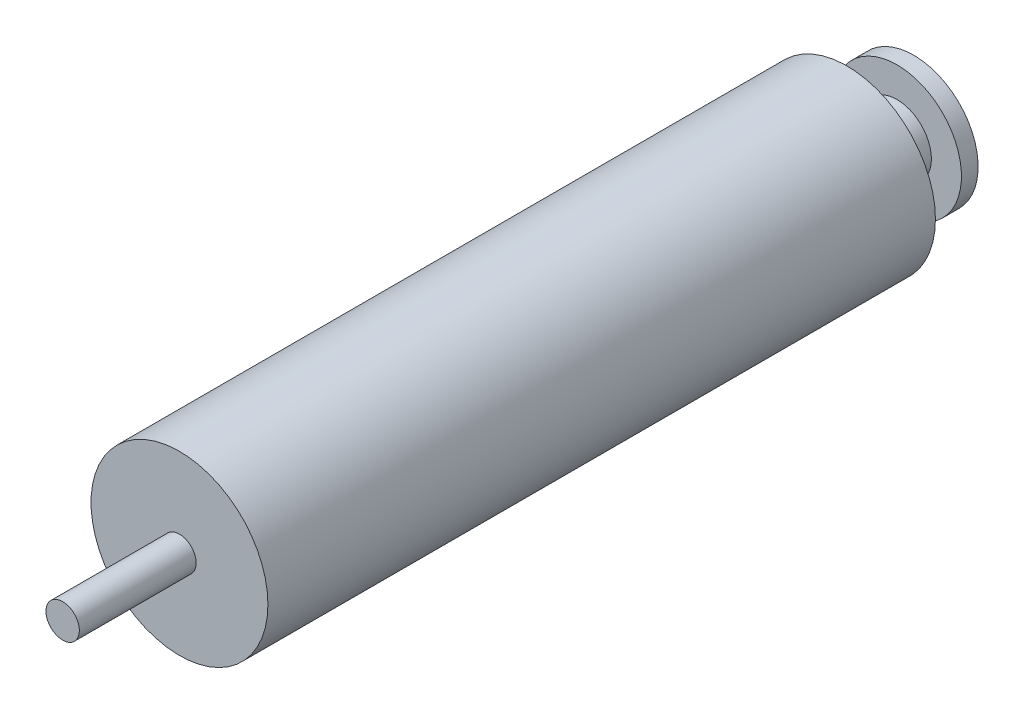
ISO-10303-21;
HEADER;
FILE_DESCRIPTION(('STEP AP214'),'2;1');
FILE_NAME('part.step','',(''),(''),'','','');
FILE_SCHEMA(('AUTOMOTIVE_DESIGN { 1 0 10303 214 1 1 1 1 }'));
ENDSEC;
DATA;
#1=APPLICATION_CONTEXT('core data for automotive mechanical design processes');
#2=APPLICATION_PROTOCOL_DEFINITION('international standard','automotive_design',2000,#1);
#3=PRODUCT_CONTEXT('',#1,'mechanical');
#4=PRODUCT('Part','Part','',(#3));
#5=PRODUCT_RELATED_PRODUCT_CATEGORY('part','',(#4));
#6=PRODUCT_DEFINITION_FORMATION('','',#4);
#7=PRODUCT_DEFINITION_CONTEXT('part definition',#1,'design');
#8=PRODUCT_DEFINITION('design','',#6,#7);
#9=PRODUCT_DEFINITION_SHAPE('','',#8);
#10=(LENGTH_UNIT() NAMED_UNIT(*) SI_UNIT(.MILLI.,.METRE.));
#11=(NAMED_UNIT(*) PLANE_ANGLE_UNIT() SI_UNIT($,.RADIAN.));
#12=(NAMED_UNIT(*) SI_UNIT($,.STERADIAN.) SOLID_ANGLE_UNIT());
#13=UNCERTAINTY_MEASURE_WITH_UNIT(LENGTH_MEASURE(1.E-05),#10,'distance_accuracy_value','');
#14=(GEOMETRIC_REPRESENTATION_CONTEXT(3) GLOBAL_UNCERTAINTY_ASSIGNED_CONTEXT((#13)) GLOBAL_UNIT_ASSIGNED_CONTEXT((#10,
#11,#12)) REPRESENTATION_CONTEXT('',''));
#15=CARTESIAN_POINT('',(0.,0.,0.));
#16=DIRECTION('',(0.,0.,1.));
#17=DIRECTION('',(1.,0.,0.));
#18=AXIS2_PLACEMENT_3D('',#15,#16,#17);
#19=CARTESIAN_POINT('',(29.6984848098349,29.6984848098351,200.));
#20=DIRECTION('',(0.,0.,-1.));
#21=DIRECTION('',(-1.,0.,0.));
#22=AXIS2_PLACEMENT_3D('',#19,#20,#21);
#23=CYLINDRICAL_SURFACE('',#22,26.5);
#24=CARTESIAN_POINT('',(29.6984848098349,29.6984848098351,200.));
#25=DIRECTION('',(0.,0.,1.));
#26=DIRECTION('',(1.,0.,0.));
#27=AXIS2_PLACEMENT_3D('',#24,#25,#26);
#28=CIRCLE('',#27,26.5);
#29=CARTESIAN_POINT('',(56.1984848098349,29.6984848098351,200.));
#30=VERTEX_POINT('',#29);
#31=EDGE_CURVE('E45',#30,#30,#28,.T.);
#32=ORIENTED_EDGE('',*,*,#31,.F.);
#33=EDGE_LOOP('',(#32));
#34=FACE_BOUND('',#33,.T.);
#35=CARTESIAN_POINT('',(29.6984848098349,29.6984848098351,0.));
#36=DIRECTION('',(0.,0.,1.));
#37=DIRECTION('',(1.,0.,0.));
#38=AXIS2_PLACEMENT_3D('',#35,#36,#37);
#39=CIRCLE('',#38,26.5);
#40=CARTESIAN_POINT('',(56.1984848098349,29.6984848098351,0.));
#41=VERTEX_POINT('',#40);
#42=EDGE_CURVE('E36',#41,#41,#39,.T.);
#43=ORIENTED_EDGE('',*,*,#42,.T.);
#44=EDGE_LOOP('',(#43));
#45=FACE_BOUND('',#44,.T.);
#46=ADVANCED_FACE('F33',(#34,#45),#23,.T.);
#47=CARTESIAN_POINT('',(29.6984848098349,29.6984848098351,200.));
#48=DIRECTION('',(0.,0.,1.));
#49=DIRECTION('',(1.,0.,0.));
#50=AXIS2_PLACEMENT_3D('',#47,#48,#49);
#51=PLANE('',#50);
#52=CARTESIAN_POINT('',(29.6984848098349,29.6984848098351,200.));
#53=DIRECTION('',(0.,0.,1.));
#54=DIRECTION('',(1.,0.,0.));
#55=AXIS2_PLACEMENT_3D('',#52,#53,#54);
#56=CIRCLE('',#55,5.);
#57=CARTESIAN_POINT('',(34.6984848098349,29.6984848098351,200.));
#58=VERTEX_POINT('',#57);
#59=EDGE_CURVE('E40',#58,#58,#56,.T.);
#60=ORIENTED_EDGE('',*,*,#59,.F.);
#61=EDGE_LOOP('',(#60));
#62=FACE_BOUND('',#61,.T.);
#63=ORIENTED_EDGE('',*,*,#31,.T.);
#64=EDGE_LOOP('',(#63));
#65=FACE_BOUND('',#64,.T.);
#66=ADVANCED_FACE('F63',(#62,#65),#51,.T.);
#67=CARTESIAN_POINT('',(29.6984848098349,29.6984848098351,0.));
#68=DIRECTION('',(0.,0.,1.));
#69=DIRECTION('',(1.,0.,0.));
#70=AXIS2_PLACEMENT_3D('',#67,#68,#69);
#71=PLANE('',#70);
#72=CARTESIAN_POINT('',(29.6984848098349,29.6984848098351,0.));
#73=DIRECTION('',(0.,0.,-1.));
#74=DIRECTION('',(-1.,0.,0.));
#75=AXIS2_PLACEMENT_3D('',#72,#73,#74);
#76=CIRCLE('',#75,10.2713602863663);
#77=CARTESIAN_POINT('',(19.4271245234686,29.6984848098351,0.));
#78=VERTEX_POINT('',#77);
#79=EDGE_CURVE('E10',#78,#78,#76,.T.);
#80=ORIENTED_EDGE('',*,*,#79,.F.);
#81=EDGE_LOOP('',(#80));
#82=FACE_BOUND('',#81,.T.);
#83=ORIENTED_EDGE('',*,*,#42,.F.);
#84=EDGE_LOOP('',(#83));
#85=FACE_BOUND('',#84,.T.);
#86=ADVANCED_FACE('F60',(#82,#85),#71,.F.);
#87=CARTESIAN_POINT('',(29.6984848098349,29.6984848098351,235.));
#88=DIRECTION('',(0.,0.,-1.));
#89=DIRECTION('',(-1.,0.,0.));
#90=AXIS2_PLACEMENT_3D('',#87,#88,#89);
#91=CYLINDRICAL_SURFACE('',#90,5.);
#92=CARTESIAN_POINT('',(29.6984848098349,29.6984848098351,235.));
#93=DIRECTION('',(0.,0.,1.));
#94=DIRECTION('',(1.,0.,0.));
#95=AXIS2_PLACEMENT_3D('',#92,#93,#94);
#96=CIRCLE('',#95,5.);
#97=CARTESIAN_POINT('',(34.6984848098349,29.6984848098351,235.));
#98=VERTEX_POINT('',#97);
#99=EDGE_CURVE('E51',#98,#98,#96,.T.);
#100=ORIENTED_EDGE('',*,*,#99,.F.);
#101=EDGE_LOOP('',(#100));
#102=FACE_BOUND('',#101,.T.);
#103=ORIENTED_EDGE('',*,*,#59,.T.);
#104=EDGE_LOOP('',(#103));
#105=FACE_BOUND('',#104,.T.);
#106=ADVANCED_FACE('F62',(#102,#105),#91,.T.);
#107=CARTESIAN_POINT('',(29.6984848098349,29.6984848098351,235.));
#108=DIRECTION('',(0.,0.,1.));
#109=DIRECTION('',(1.,0.,0.));
#110=AXIS2_PLACEMENT_3D('',#107,#108,#109);
#111=PLANE('',#110);
#112=ORIENTED_EDGE('',*,*,#99,.T.);
#113=EDGE_LOOP('',(#112));
#114=FACE_BOUND('',#113,.T.);
#115=ADVANCED_FACE('F69',(#114),#111,.T.);
#116=CARTESIAN_POINT('',(29.6984848098349,29.6984848098351,-15.));
#117=DIRECTION('',(0.,0.,1.));
#118=DIRECTION('',(1.,0.,0.));
#119=AXIS2_PLACEMENT_3D('',#116,#117,#118);
#120=CYLINDRICAL_SURFACE('',#119,10.2713602863663);
#121=CARTESIAN_POINT('',(29.6984848098349,29.6984848098351,-15.));
#122=DIRECTION('',(0.,0.,-1.));
#123=DIRECTION('',(-1.,0.,0.));
#124=AXIS2_PLACEMENT_3D('',#121,#122,#123);
#125=CIRCLE('',#124,10.2713602863663);
#126=CARTESIAN_POINT('',(19.4271245234686,29.6984848098351,-15.));
#127=VERTEX_POINT('',#126);
#128=EDGE_CURVE('E49',#127,#127,#125,.T.);
#129=ORIENTED_EDGE('',*,*,#128,.F.);
#130=EDGE_LOOP('',(#129));
#131=FACE_BOUND('',#130,.T.);
#132=ORIENTED_EDGE('',*,*,#79,.T.);
#133=EDGE_LOOP('',(#132));
#134=FACE_BOUND('',#133,.T.);
#135=ADVANCED_FACE('F97',(#131,#134),#120,.T.);
#136=CARTESIAN_POINT('',(29.6984848098349,29.6984848098351,-20.));
#137=DIRECTION('',(0.,0.,1.));
#138=DIRECTION('',(1.,0.,0.));
#139=AXIS2_PLACEMENT_3D('',#136,#137,#138);
#140=CYLINDRICAL_SURFACE('',#139,19.2882601315168);
#141=CARTESIAN_POINT('',(29.6984848098349,29.6984848098351,-20.));
#142=DIRECTION('',(0.,0.,-1.));
#143=DIRECTION('',(-1.,0.,0.));
#144=AXIS2_PLACEMENT_3D('',#141,#142,#143);
#145=CIRCLE('',#144,19.2882601315168);
#146=CARTESIAN_POINT('',(10.4102246783181,29.6984848098351,-20.));
#147=VERTEX_POINT('',#146);
#148=EDGE_CURVE('E152',#147,#147,#145,.T.);
#149=ORIENTED_EDGE('',*,*,#148,.F.);
#150=EDGE_LOOP('',(#149));
#151=FACE_BOUND('',#150,.T.);
#152=CARTESIAN_POINT('',(29.6984848098349,29.6984848098351,-15.));
#153=DIRECTION('',(0.,0.,-1.));
#154=DIRECTION('',(-1.,0.,0.));
#155=AXIS2_PLACEMENT_3D('',#152,#153,#154);
#156=CIRCLE('',#155,19.2882601315168);
#157=CARTESIAN_POINT('',(10.4102246783181,29.6984848098351,-15.));
#158=VERTEX_POINT('',#157);
#159=EDGE_CURVE('E150',#158,#158,#156,.T.);
#160=ORIENTED_EDGE('',*,*,#159,.T.);
#161=EDGE_LOOP('',(#160));
#162=FACE_BOUND('',#161,.T.);
#163=ADVANCED_FACE('F111',(#151,#162),#140,.T.);
#164=CARTESIAN_POINT('',(29.6984848098349,29.6984848098351,-20.));
#165=DIRECTION('',(0.,0.,-1.));
#166=DIRECTION('',(-1.,0.,0.));
#167=AXIS2_PLACEMENT_3D('',#164,#165,#166);
#168=PLANE('',#167);
#169=ORIENTED_EDGE('',*,*,#148,.T.);
#170=EDGE_LOOP('',(#169));
#171=FACE_BOUND('',#170,.T.);
#172=ADVANCED_FACE('F121',(#171),#168,.T.);
#173=CARTESIAN_POINT('',(29.6984848098349,29.6984848098351,-15.));
#174=DIRECTION('',(0.,0.,-1.));
#175=DIRECTION('',(-1.,0.,0.));
#176=AXIS2_PLACEMENT_3D('',#173,#174,#175);
#177=PLANE('',#176);
#178=ORIENTED_EDGE('',*,*,#128,.T.);
#179=EDGE_LOOP('',(#178));
#180=FACE_BOUND('',#179,.T.);
#181=ORIENTED_EDGE('',*,*,#159,.F.);
#182=EDGE_LOOP('',(#181));
#183=FACE_BOUND('',#182,.T.);
#184=ADVANCED_FACE('F131',(#180,#183),#177,.F.);
#185=CLOSED_SHELL('',(#46,#66,#86,#106,#115,#135,#163,#172,#184));
#186=MANIFOLD_SOLID_BREP('B2',#185);
#187=ADVANCED_BREP_SHAPE_REPRESENTATION('',(#18,#186),#14);
#188=SHAPE_DEFINITION_REPRESENTATION(#9,#187);
ENDSEC;
END-ISO-10303-21;
